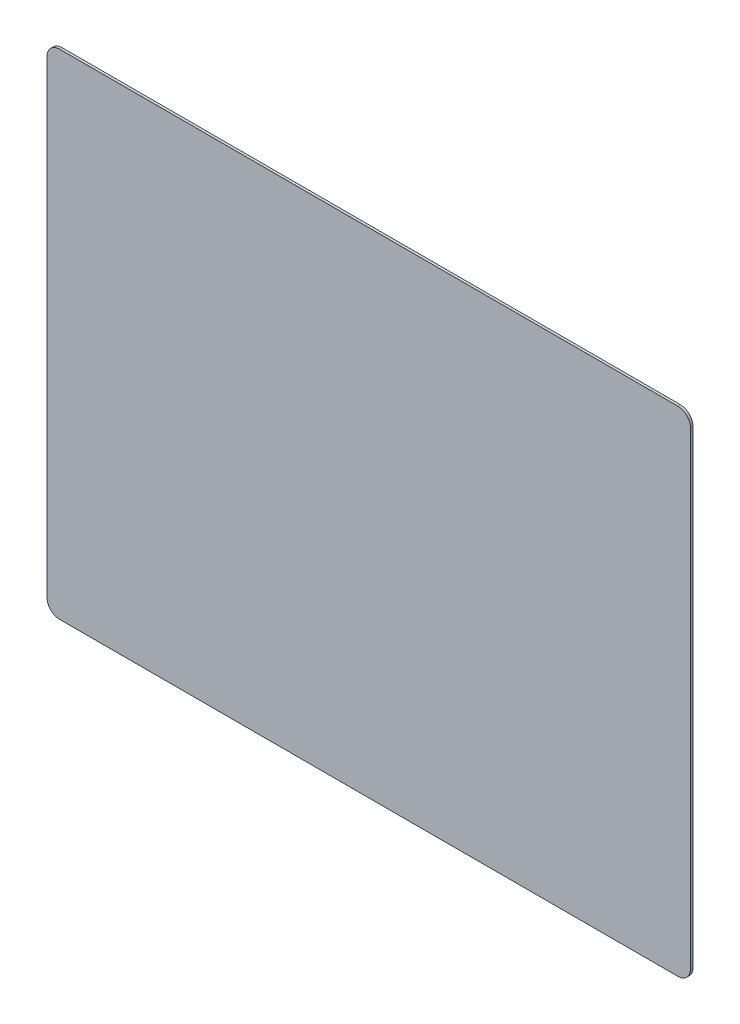
ISO-10303-21;
HEADER;
FILE_DESCRIPTION(('STEP AP214'),'2;1');
FILE_NAME('part.step','',(''),(''),'','','');
FILE_SCHEMA(('AUTOMOTIVE_DESIGN { 1 0 10303 214 1 1 1 1 }'));
ENDSEC;
DATA;
#1=APPLICATION_CONTEXT('core data for automotive mechanical design processes');
#2=APPLICATION_PROTOCOL_DEFINITION('international standard','automotive_design',2000,#1);
#3=PRODUCT_CONTEXT('',#1,'mechanical');
#4=PRODUCT('Part','Part','',(#3));
#5=PRODUCT_RELATED_PRODUCT_CATEGORY('part','',(#4));
#6=PRODUCT_DEFINITION_FORMATION('','',#4);
#7=PRODUCT_DEFINITION_CONTEXT('part definition',#1,'design');
#8=PRODUCT_DEFINITION('design','',#6,#7);
#9=PRODUCT_DEFINITION_SHAPE('','',#8);
#10=(LENGTH_UNIT() NAMED_UNIT(*) SI_UNIT(.MILLI.,.METRE.));
#11=(NAMED_UNIT(*) PLANE_ANGLE_UNIT() SI_UNIT($,.RADIAN.));
#12=(NAMED_UNIT(*) SI_UNIT($,.STERADIAN.) SOLID_ANGLE_UNIT());
#13=UNCERTAINTY_MEASURE_WITH_UNIT(LENGTH_MEASURE(1.E-05),#10,'distance_accuracy_value','');
#14=(GEOMETRIC_REPRESENTATION_CONTEXT(3) GLOBAL_UNCERTAINTY_ASSIGNED_CONTEXT((#13)) GLOBAL_UNIT_ASSIGNED_CONTEXT((#10,
#11,#12)) REPRESENTATION_CONTEXT('',''));
#15=CARTESIAN_POINT('',(0.,0.,0.));
#16=DIRECTION('',(0.,0.,1.));
#17=DIRECTION('',(1.,0.,0.));
#18=AXIS2_PLACEMENT_3D('',#15,#16,#17);
#19=CARTESIAN_POINT('',(505.,-387.5,4.));
#20=DIRECTION('',(-1.,0.,0.));
#21=DIRECTION('',(0.,0.,1.));
#22=AXIS2_PLACEMENT_3D('',#19,#20,#21);
#23=PLANE('',#22);
#24=DIRECTION('',(0.,1.,0.));
#25=VECTOR('',#24,1.);
#26=CARTESIAN_POINT('',(505.,-387.5,0.));
#27=LINE('',#26,#25);
#28=CARTESIAN_POINT('',(505.,-367.5,0.));
#29=VERTEX_POINT('',#28);
#30=CARTESIAN_POINT('',(505.,367.5,0.));
#31=VERTEX_POINT('',#30);
#32=EDGE_CURVE('E157',#29,#31,#27,.T.);
#33=ORIENTED_EDGE('',*,*,#32,.T.);
#34=DIRECTION('',(0.,0.,-1.));
#35=VECTOR('',#34,1.);
#36=CARTESIAN_POINT('',(505.,367.5,4.));
#37=LINE('',#36,#35);
#38=CARTESIAN_POINT('',(505.,367.5,4.));
#39=VERTEX_POINT('',#38);
#40=EDGE_CURVE('E11',#31,#39,#37,.F.);
#41=ORIENTED_EDGE('',*,*,#40,.T.);
#42=DIRECTION('',(0.,1.,0.));
#43=VECTOR('',#42,1.);
#44=CARTESIAN_POINT('',(505.,-387.5,4.));
#45=LINE('',#44,#43);
#46=CARTESIAN_POINT('',(505.,-367.5,4.));
#47=VERTEX_POINT('',#46);
#48=EDGE_CURVE('E125',#47,#39,#45,.T.);
#49=ORIENTED_EDGE('',*,*,#48,.F.);
#50=DIRECTION('',(0.,0.,-1.));
#51=VECTOR('',#50,1.);
#52=CARTESIAN_POINT('',(505.,-367.5,4.));
#53=LINE('',#52,#51);
#54=EDGE_CURVE('E41',#47,#29,#53,.T.);
#55=ORIENTED_EDGE('',*,*,#54,.T.);
#56=EDGE_LOOP('',(#33,#41,#49,#55));
#57=FACE_BOUND('',#56,.T.);
#58=ADVANCED_FACE('F33',(#57),#23,.F.);
#59=CARTESIAN_POINT('',(-505.,387.5,4.));
#60=DIRECTION('',(0.,-1.,0.));
#61=DIRECTION('',(0.,0.,-1.));
#62=AXIS2_PLACEMENT_3D('',#59,#60,#61);
#63=PLANE('',#62);
#64=DIRECTION('',(-1.,0.,0.));
#65=VECTOR('',#64,1.);
#66=CARTESIAN_POINT('',(-505.,387.5,0.));
#67=LINE('',#66,#65);
#68=CARTESIAN_POINT('',(485.,387.5,0.));
#69=VERTEX_POINT('',#68);
#70=CARTESIAN_POINT('',(-485.,387.5,0.));
#71=VERTEX_POINT('',#70);
#72=EDGE_CURVE('E130',#69,#71,#67,.T.);
#73=ORIENTED_EDGE('',*,*,#72,.T.);
#74=DIRECTION('',(0.,0.,-1.));
#75=VECTOR('',#74,1.);
#76=CARTESIAN_POINT('',(-485.,387.5,4.));
#77=LINE('',#76,#75);
#78=CARTESIAN_POINT('',(-485.,387.5,4.));
#79=VERTEX_POINT('',#78);
#80=EDGE_CURVE('E48',#71,#79,#77,.F.);
#81=ORIENTED_EDGE('',*,*,#80,.T.);
#82=DIRECTION('',(-1.,0.,0.));
#83=VECTOR('',#82,1.);
#84=CARTESIAN_POINT('',(-505.,387.5,4.));
#85=LINE('',#84,#83);
#86=CARTESIAN_POINT('',(485.,387.5,4.));
#87=VERTEX_POINT('',#86);
#88=EDGE_CURVE('E128',#87,#79,#85,.T.);
#89=ORIENTED_EDGE('',*,*,#88,.F.);
#90=DIRECTION('',(0.,0.,-1.));
#91=VECTOR('',#90,1.);
#92=CARTESIAN_POINT('',(485.,387.5,4.));
#93=LINE('',#92,#91);
#94=EDGE_CURVE('E149',#87,#69,#93,.T.);
#95=ORIENTED_EDGE('',*,*,#94,.T.);
#96=EDGE_LOOP('',(#73,#81,#89,#95));
#97=FACE_BOUND('',#96,.T.);
#98=ADVANCED_FACE('F177',(#97),#63,.F.);
#99=CARTESIAN_POINT('',(-505.,-387.5,4.));
#100=DIRECTION('',(1.,0.,0.));
#101=DIRECTION('',(0.,0.,-1.));
#102=AXIS2_PLACEMENT_3D('',#99,#100,#101);
#103=PLANE('',#102);
#104=DIRECTION('',(0.,-1.,0.));
#105=VECTOR('',#104,1.);
#106=CARTESIAN_POINT('',(-505.,-387.5,0.));
#107=LINE('',#106,#105);
#108=CARTESIAN_POINT('',(-505.,367.5,0.));
#109=VERTEX_POINT('',#108);
#110=CARTESIAN_POINT('',(-505.,-367.5,0.));
#111=VERTEX_POINT('',#110);
#112=EDGE_CURVE('E126',#109,#111,#107,.T.);
#113=ORIENTED_EDGE('',*,*,#112,.T.);
#114=DIRECTION('',(0.,0.,-1.));
#115=VECTOR('',#114,1.);
#116=CARTESIAN_POINT('',(-505.,-367.5,4.));
#117=LINE('',#116,#115);
#118=CARTESIAN_POINT('',(-505.,-367.5,4.));
#119=VERTEX_POINT('',#118);
#120=EDGE_CURVE('E104',#111,#119,#117,.F.);
#121=ORIENTED_EDGE('',*,*,#120,.T.);
#122=DIRECTION('',(0.,-1.,0.));
#123=VECTOR('',#122,1.);
#124=CARTESIAN_POINT('',(-505.,-387.5,4.));
#125=LINE('',#124,#123);
#126=CARTESIAN_POINT('',(-505.,367.5,4.));
#127=VERTEX_POINT('',#126);
#128=EDGE_CURVE('E165',#127,#119,#125,.T.);
#129=ORIENTED_EDGE('',*,*,#128,.F.);
#130=DIRECTION('',(0.,0.,-1.));
#131=VECTOR('',#130,1.);
#132=CARTESIAN_POINT('',(-505.,367.5,4.));
#133=LINE('',#132,#131);
#134=EDGE_CURVE('E109',#127,#109,#133,.T.);
#135=ORIENTED_EDGE('',*,*,#134,.T.);
#136=EDGE_LOOP('',(#113,#121,#129,#135));
#137=FACE_BOUND('',#136,.T.);
#138=ADVANCED_FACE('F176',(#137),#103,.F.);
#139=CARTESIAN_POINT('',(-505.,-387.5,4.));
#140=DIRECTION('',(0.,1.,0.));
#141=DIRECTION('',(0.,0.,1.));
#142=AXIS2_PLACEMENT_3D('',#139,#140,#141);
#143=PLANE('',#142);
#144=DIRECTION('',(1.,0.,0.));
#145=VECTOR('',#144,1.);
#146=CARTESIAN_POINT('',(-505.,-387.5,4.));
#147=LINE('',#146,#145);
#148=CARTESIAN_POINT('',(-485.,-387.5,4.));
#149=VERTEX_POINT('',#148);
#150=CARTESIAN_POINT('',(485.,-387.5,4.));
#151=VERTEX_POINT('',#150);
#152=EDGE_CURVE('E119',#149,#151,#147,.T.);
#153=ORIENTED_EDGE('',*,*,#152,.F.);
#154=DIRECTION('',(0.,0.,-1.));
#155=VECTOR('',#154,1.);
#156=CARTESIAN_POINT('',(-485.,-387.5,4.));
#157=LINE('',#156,#155);
#158=CARTESIAN_POINT('',(-485.,-387.5,0.));
#159=VERTEX_POINT('',#158);
#160=EDGE_CURVE('E103',#149,#159,#157,.T.);
#161=ORIENTED_EDGE('',*,*,#160,.T.);
#162=DIRECTION('',(1.,0.,0.));
#163=VECTOR('',#162,1.);
#164=CARTESIAN_POINT('',(-505.,-387.5,0.));
#165=LINE('',#164,#163);
#166=CARTESIAN_POINT('',(485.,-387.5,0.));
#167=VERTEX_POINT('',#166);
#168=EDGE_CURVE('E116',#159,#167,#165,.T.);
#169=ORIENTED_EDGE('',*,*,#168,.T.);
#170=DIRECTION('',(0.,0.,-1.));
#171=VECTOR('',#170,1.);
#172=CARTESIAN_POINT('',(485.,-387.5,4.));
#173=LINE('',#172,#171);
#174=EDGE_CURVE('E121',#167,#151,#173,.F.);
#175=ORIENTED_EDGE('',*,*,#174,.T.);
#176=EDGE_LOOP('',(#153,#161,#169,#175));
#177=FACE_BOUND('',#176,.T.);
#178=ADVANCED_FACE('F115',(#177),#143,.F.);
#179=CARTESIAN_POINT('',(0.,0.,4.));
#180=DIRECTION('',(0.,0.,-1.));
#181=DIRECTION('',(-1.,0.,0.));
#182=AXIS2_PLACEMENT_3D('',#179,#180,#181);
#183=PLANE('',#182);
#184=ORIENTED_EDGE('',*,*,#128,.T.);
#185=CARTESIAN_POINT('',(-485.,-367.5,4.));
#186=DIRECTION('',(0.,0.,-1.));
#187=DIRECTION('',(-1.,0.,0.));
#188=AXIS2_PLACEMENT_3D('',#185,#186,#187);
#189=CIRCLE('',#188,20.);
#190=EDGE_CURVE('E147',#119,#149,#189,.F.);
#191=ORIENTED_EDGE('',*,*,#190,.T.);
#192=ORIENTED_EDGE('',*,*,#152,.T.);
#193=CARTESIAN_POINT('',(485.,-367.5,4.));
#194=DIRECTION('',(0.,0.,-1.));
#195=DIRECTION('',(-1.,0.,0.));
#196=AXIS2_PLACEMENT_3D('',#193,#194,#195);
#197=CIRCLE('',#196,20.);
#198=EDGE_CURVE('E142',#151,#47,#197,.F.);
#199=ORIENTED_EDGE('',*,*,#198,.T.);
#200=ORIENTED_EDGE('',*,*,#48,.T.);
#201=CARTESIAN_POINT('',(485.,367.5,4.));
#202=DIRECTION('',(0.,0.,-1.));
#203=DIRECTION('',(-1.,0.,0.));
#204=AXIS2_PLACEMENT_3D('',#201,#202,#203);
#205=CIRCLE('',#204,20.);
#206=EDGE_CURVE('E55',#39,#87,#205,.F.);
#207=ORIENTED_EDGE('',*,*,#206,.T.);
#208=ORIENTED_EDGE('',*,*,#88,.T.);
#209=CARTESIAN_POINT('',(-485.,367.5,4.));
#210=DIRECTION('',(0.,0.,-1.));
#211=DIRECTION('',(-1.,0.,0.));
#212=AXIS2_PLACEMENT_3D('',#209,#210,#211);
#213=CIRCLE('',#212,20.);
#214=EDGE_CURVE('E145',#79,#127,#213,.F.);
#215=ORIENTED_EDGE('',*,*,#214,.T.);
#216=EDGE_LOOP('',(#184,#191,#192,#199,#200,#207,#208,#215));
#217=FACE_BOUND('',#216,.T.);
#218=ADVANCED_FACE('F169',(#217),#183,.F.);
#219=CARTESIAN_POINT('',(0.,0.,0.));
#220=DIRECTION('',(0.,0.,-1.));
#221=DIRECTION('',(-1.,0.,0.));
#222=AXIS2_PLACEMENT_3D('',#219,#220,#221);
#223=PLANE('',#222);
#224=ORIENTED_EDGE('',*,*,#168,.F.);
#225=CARTESIAN_POINT('',(-485.,-367.5,0.));
#226=DIRECTION('',(0.,0.,-1.));
#227=DIRECTION('',(-1.,0.,0.));
#228=AXIS2_PLACEMENT_3D('',#225,#226,#227);
#229=CIRCLE('',#228,20.);
#230=EDGE_CURVE('E99',#159,#111,#229,.T.);
#231=ORIENTED_EDGE('',*,*,#230,.T.);
#232=ORIENTED_EDGE('',*,*,#112,.F.);
#233=CARTESIAN_POINT('',(-485.,367.5,0.));
#234=DIRECTION('',(0.,0.,-1.));
#235=DIRECTION('',(-1.,0.,0.));
#236=AXIS2_PLACEMENT_3D('',#233,#234,#235);
#237=CIRCLE('',#236,20.);
#238=EDGE_CURVE('E110',#109,#71,#237,.T.);
#239=ORIENTED_EDGE('',*,*,#238,.T.);
#240=ORIENTED_EDGE('',*,*,#72,.F.);
#241=CARTESIAN_POINT('',(485.,367.5,0.));
#242=DIRECTION('',(0.,0.,-1.));
#243=DIRECTION('',(-1.,0.,0.));
#244=AXIS2_PLACEMENT_3D('',#241,#242,#243);
#245=CIRCLE('',#244,20.);
#246=EDGE_CURVE('E136',#69,#31,#245,.T.);
#247=ORIENTED_EDGE('',*,*,#246,.T.);
#248=ORIENTED_EDGE('',*,*,#32,.F.);
#249=CARTESIAN_POINT('',(485.,-367.5,0.));
#250=DIRECTION('',(0.,0.,-1.));
#251=DIRECTION('',(-1.,0.,0.));
#252=AXIS2_PLACEMENT_3D('',#249,#250,#251);
#253=CIRCLE('',#252,20.);
#254=EDGE_CURVE('E120',#29,#167,#253,.T.);
#255=ORIENTED_EDGE('',*,*,#254,.T.);
#256=EDGE_LOOP('',(#224,#231,#232,#239,#240,#247,#248,#255));
#257=FACE_BOUND('',#256,.T.);
#258=ADVANCED_FACE('F123',(#257),#223,.T.);
#259=CARTESIAN_POINT('',(-485.,-367.5,4.));
#260=DIRECTION('',(0.,0.,-1.));
#261=DIRECTION('',(-1.,0.,0.));
#262=AXIS2_PLACEMENT_3D('',#259,#260,#261);
#263=CYLINDRICAL_SURFACE('',#262,20.);
#264=ORIENTED_EDGE('',*,*,#190,.F.);
#265=ORIENTED_EDGE('',*,*,#120,.F.);
#266=ORIENTED_EDGE('',*,*,#230,.F.);
#267=ORIENTED_EDGE('',*,*,#160,.F.);
#268=EDGE_LOOP('',(#264,#265,#266,#267));
#269=FACE_BOUND('',#268,.T.);
#270=ADVANCED_FACE('F102',(#269),#263,.T.);
#271=CARTESIAN_POINT('',(-485.,367.5,4.));
#272=DIRECTION('',(0.,0.,-1.));
#273=DIRECTION('',(-1.,0.,0.));
#274=AXIS2_PLACEMENT_3D('',#271,#272,#273);
#275=CYLINDRICAL_SURFACE('',#274,20.);
#276=ORIENTED_EDGE('',*,*,#214,.F.);
#277=ORIENTED_EDGE('',*,*,#80,.F.);
#278=ORIENTED_EDGE('',*,*,#238,.F.);
#279=ORIENTED_EDGE('',*,*,#134,.F.);
#280=EDGE_LOOP('',(#276,#277,#278,#279));
#281=FACE_BOUND('',#280,.T.);
#282=ADVANCED_FACE('F174',(#281),#275,.T.);
#283=CARTESIAN_POINT('',(485.,367.5,4.));
#284=DIRECTION('',(0.,0.,-1.));
#285=DIRECTION('',(-1.,0.,0.));
#286=AXIS2_PLACEMENT_3D('',#283,#284,#285);
#287=CYLINDRICAL_SURFACE('',#286,20.);
#288=ORIENTED_EDGE('',*,*,#206,.F.);
#289=ORIENTED_EDGE('',*,*,#40,.F.);
#290=ORIENTED_EDGE('',*,*,#246,.F.);
#291=ORIENTED_EDGE('',*,*,#94,.F.);
#292=EDGE_LOOP('',(#288,#289,#290,#291));
#293=FACE_BOUND('',#292,.T.);
#294=ADVANCED_FACE('F179',(#293),#287,.T.);
#295=CARTESIAN_POINT('',(485.,-367.5,4.));
#296=DIRECTION('',(0.,0.,-1.));
#297=DIRECTION('',(-1.,0.,0.));
#298=AXIS2_PLACEMENT_3D('',#295,#296,#297);
#299=CYLINDRICAL_SURFACE('',#298,20.);
#300=ORIENTED_EDGE('',*,*,#198,.F.);
#301=ORIENTED_EDGE('',*,*,#174,.F.);
#302=ORIENTED_EDGE('',*,*,#254,.F.);
#303=ORIENTED_EDGE('',*,*,#54,.F.);
#304=EDGE_LOOP('',(#300,#301,#302,#303));
#305=FACE_BOUND('',#304,.T.);
#306=ADVANCED_FACE('F35',(#305),#299,.T.);
#307=CLOSED_SHELL('',(#58,#98,#138,#178,#218,#258,#270,#282,#294,#306));
#308=MANIFOLD_SOLID_BREP('B2',#307);
#309=ADVANCED_BREP_SHAPE_REPRESENTATION('',(#18,#308),#14);
#310=SHAPE_DEFINITION_REPRESENTATION(#9,#309);
ENDSEC;
END-ISO-10303-21;
